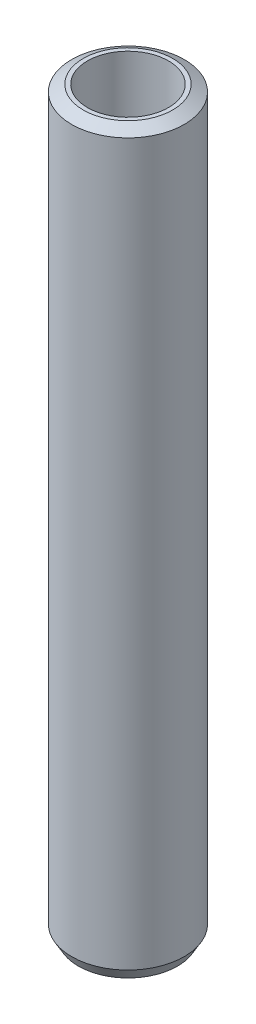
ISO-10303-21;
HEADER;
FILE_DESCRIPTION(('STEP AP214'),'2;1');
FILE_NAME('part.step','',(''),(''),'','','');
FILE_SCHEMA(('AUTOMOTIVE_DESIGN { 1 0 10303 214 1 1 1 1 }'));
ENDSEC;
DATA;
#1=APPLICATION_CONTEXT('core data for automotive mechanical design processes');
#2=APPLICATION_PROTOCOL_DEFINITION('international standard','automotive_design',2000,#1);
#3=PRODUCT_CONTEXT('',#1,'mechanical');
#4=PRODUCT('Part','Part','',(#3));
#5=PRODUCT_RELATED_PRODUCT_CATEGORY('part','',(#4));
#6=PRODUCT_DEFINITION_FORMATION('','',#4);
#7=PRODUCT_DEFINITION_CONTEXT('part definition',#1,'design');
#8=PRODUCT_DEFINITION('design','',#6,#7);
#9=PRODUCT_DEFINITION_SHAPE('','',#8);
#10=(LENGTH_UNIT() NAMED_UNIT(*) SI_UNIT(.MILLI.,.METRE.));
#11=(NAMED_UNIT(*) PLANE_ANGLE_UNIT() SI_UNIT($,.RADIAN.));
#12=(NAMED_UNIT(*) SI_UNIT($,.STERADIAN.) SOLID_ANGLE_UNIT());
#13=UNCERTAINTY_MEASURE_WITH_UNIT(LENGTH_MEASURE(1.E-05),#10,'distance_accuracy_value','');
#14=(GEOMETRIC_REPRESENTATION_CONTEXT(3) GLOBAL_UNCERTAINTY_ASSIGNED_CONTEXT((#13)) GLOBAL_UNIT_ASSIGNED_CONTEXT((#10,
#11,#12)) REPRESENTATION_CONTEXT('',''));
#15=CARTESIAN_POINT('',(0.,0.,0.));
#16=DIRECTION('',(0.,0.,1.));
#17=DIRECTION('',(1.,0.,0.));
#18=AXIS2_PLACEMENT_3D('',#15,#16,#17);
#19=CARTESIAN_POINT('',(0.,262.518422192516,0.));
#20=DIRECTION('',(0.,-1.,0.));
#21=DIRECTION('',(0.,0.,-1.));
#22=AXIS2_PLACEMENT_3D('',#19,#20,#21);
#23=CYLINDRICAL_SURFACE('',#22,20.);
#24=CARTESIAN_POINT('',(0.,260.139250990155,0.));
#25=DIRECTION('',(0.,1.,0.));
#26=DIRECTION('',(0.,0.,1.));
#27=AXIS2_PLACEMENT_3D('',#24,#25,#26);
#28=CIRCLE('',#27,20.);
#29=CARTESIAN_POINT('',(0.,260.139250990155,20.));
#30=VERTEX_POINT('',#29);
#31=EDGE_CURVE('E50',#30,#30,#28,.F.);
#32=ORIENTED_EDGE('',*,*,#31,.T.);
#33=EDGE_LOOP('',(#32));
#34=FACE_BOUND('',#33,.T.);
#35=CARTESIAN_POINT('',(0.,4.12084540239377,0.));
#36=DIRECTION('',(0.,1.,0.));
#37=DIRECTION('',(0.,0.,1.));
#38=AXIS2_PLACEMENT_3D('',#35,#36,#37);
#39=CIRCLE('',#38,20.);
#40=CARTESIAN_POINT('',(0.,4.12084540239377,20.));
#41=VERTEX_POINT('',#40);
#42=EDGE_CURVE('E51',#41,#41,#39,.T.);
#43=ORIENTED_EDGE('',*,*,#42,.T.);
#44=EDGE_LOOP('',(#43));
#45=FACE_BOUND('',#44,.T.);
#46=ADVANCED_FACE('F39',(#34,#45),#23,.T.);
#47=CARTESIAN_POINT('',(0.,262.518422192516,0.));
#48=DIRECTION('',(0.,1.,0.));
#49=DIRECTION('',(0.,0.,1.));
#50=AXIS2_PLACEMENT_3D('',#47,#48,#49);
#51=PLANE('',#50);
#52=CARTESIAN_POINT('',(0.,262.518422192516,0.));
#53=DIRECTION('',(0.,1.,0.));
#54=DIRECTION('',(0.,0.,1.));
#55=AXIS2_PLACEMENT_3D('',#52,#53,#54);
#56=CIRCLE('',#55,15.8791545976061);
#57=CARTESIAN_POINT('',(0.,262.518422192516,15.8791545976061));
#58=VERTEX_POINT('',#57);
#59=EDGE_CURVE('E54',#58,#58,#56,.T.);
#60=ORIENTED_EDGE('',*,*,#59,.T.);
#61=EDGE_LOOP('',(#60));
#62=FACE_BOUND('',#61,.T.);
#63=CARTESIAN_POINT('',(0.,262.518422192516,0.));
#64=DIRECTION('',(0.,1.,0.));
#65=DIRECTION('',(0.,0.,1.));
#66=AXIS2_PLACEMENT_3D('',#63,#64,#65);
#67=CIRCLE('',#66,14.3899514156634);
#68=CARTESIAN_POINT('',(0.,262.518422192516,14.3899514156634));
#69=VERTEX_POINT('',#68);
#70=EDGE_CURVE('E58',#69,#69,#67,.T.);
#71=ORIENTED_EDGE('',*,*,#70,.F.);
#72=EDGE_LOOP('',(#71));
#73=FACE_BOUND('',#72,.T.);
#74=ADVANCED_FACE('F69',(#62,#73),#51,.T.);
#75=CARTESIAN_POINT('',(0.,0.,0.));
#76=DIRECTION('',(0.,1.,0.));
#77=DIRECTION('',(0.,0.,1.));
#78=AXIS2_PLACEMENT_3D('',#75,#76,#77);
#79=PLANE('',#78);
#80=CARTESIAN_POINT('',(0.,0.,0.));
#81=DIRECTION('',(0.,1.,0.));
#82=DIRECTION('',(0.,0.,1.));
#83=AXIS2_PLACEMENT_3D('',#80,#81,#82);
#84=CIRCLE('',#83,17.6208287976391);
#85=CARTESIAN_POINT('',(0.,0.,17.6208287976391));
#86=VERTEX_POINT('',#85);
#87=EDGE_CURVE('E10',#86,#86,#84,.F.);
#88=ORIENTED_EDGE('',*,*,#87,.T.);
#89=EDGE_LOOP('',(#88));
#90=FACE_BOUND('',#89,.T.);
#91=CARTESIAN_POINT('',(0.,0.,0.));
#92=DIRECTION('',(0.,1.,0.));
#93=DIRECTION('',(0.,0.,1.));
#94=AXIS2_PLACEMENT_3D('',#91,#92,#93);
#95=CIRCLE('',#94,14.3899514156634);
#96=CARTESIAN_POINT('',(0.,0.,14.3899514156634));
#97=VERTEX_POINT('',#96);
#98=EDGE_CURVE('E63',#97,#97,#95,.T.);
#99=ORIENTED_EDGE('',*,*,#98,.T.);
#100=EDGE_LOOP('',(#99));
#101=FACE_BOUND('',#100,.T.);
#102=ADVANCED_FACE('F75',(#90,#101),#79,.F.);
#103=CARTESIAN_POINT('',(0.,262.518422192516,0.));
#104=DIRECTION('',(0.,-1.,0.));
#105=DIRECTION('',(0.,0.,-1.));
#106=AXIS2_PLACEMENT_3D('',#103,#104,#105);
#107=CYLINDRICAL_SURFACE('',#106,14.3899514156634);
#108=ORIENTED_EDGE('',*,*,#70,.T.);
#109=EDGE_LOOP('',(#108));
#110=FACE_BOUND('',#109,.T.);
#111=ORIENTED_EDGE('',*,*,#98,.F.);
#112=EDGE_LOOP('',(#111));
#113=FACE_BOUND('',#112,.T.);
#114=ADVANCED_FACE('F70',(#110,#113),#107,.F.);
#115=CARTESIAN_POINT('',(0.,262.518422192516,0.));
#116=DIRECTION('',(0.,-1.,0.));
#117=DIRECTION('',(0.,0.,-1.));
#118=AXIS2_PLACEMENT_3D('',#115,#116,#117);
#119=CONICAL_SURFACE('',#118,15.8791545976061,1.0471975511966);
#120=ORIENTED_EDGE('',*,*,#31,.F.);
#121=EDGE_LOOP('',(#120));
#122=FACE_BOUND('',#121,.T.);
#123=ORIENTED_EDGE('',*,*,#59,.F.);
#124=EDGE_LOOP('',(#123));
#125=FACE_BOUND('',#124,.T.);
#126=ADVANCED_FACE('F81',(#122,#125),#119,.T.);
#127=CARTESIAN_POINT('',(0.,4.12084540239377,0.));
#128=DIRECTION('',(0.,1.,0.));
#129=DIRECTION('',(0.,0.,1.));
#130=AXIS2_PLACEMENT_3D('',#127,#128,#129);
#131=CONICAL_SURFACE('',#130,20.,0.523598775598301);
#132=ORIENTED_EDGE('',*,*,#87,.F.);
#133=EDGE_LOOP('',(#132));
#134=FACE_BOUND('',#133,.T.);
#135=ORIENTED_EDGE('',*,*,#42,.F.);
#136=EDGE_LOOP('',(#135));
#137=FACE_BOUND('',#136,.T.);
#138=ADVANCED_FACE('F45',(#134,#137),#131,.T.);
#139=CLOSED_SHELL('',(#46,#74,#102,#114,#126,#138));
#140=MANIFOLD_SOLID_BREP('B2',#139);
#141=ADVANCED_BREP_SHAPE_REPRESENTATION('',(#18,#140),#14);
#142=SHAPE_DEFINITION_REPRESENTATION(#9,#141);
ENDSEC;
END-ISO-10303-21;
